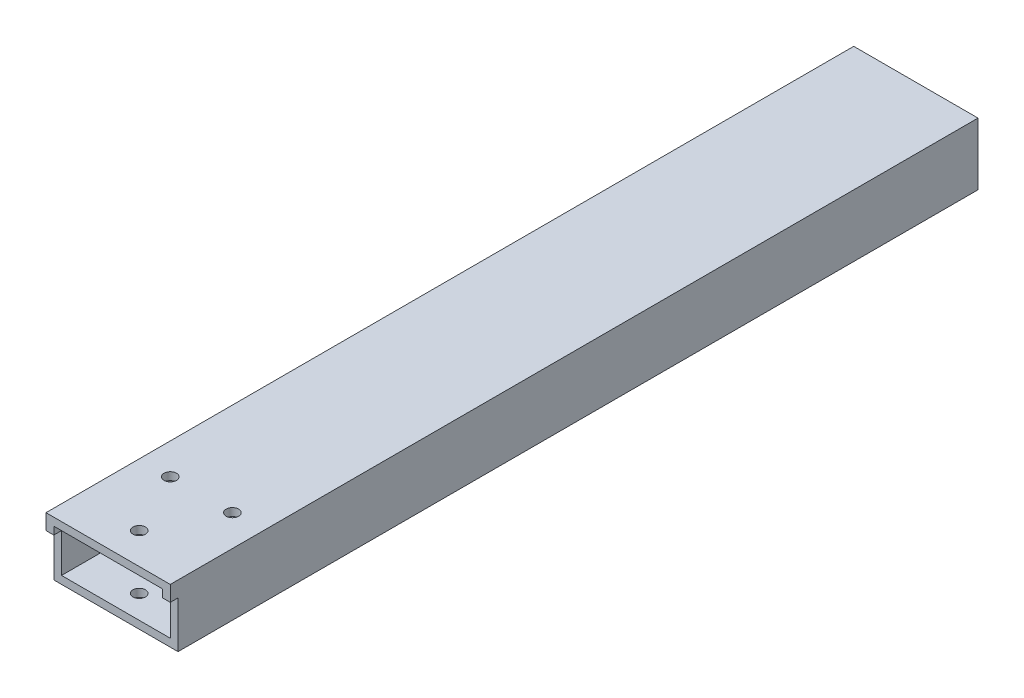
ISO-10303-21;
HEADER;
FILE_DESCRIPTION(('STEP AP214'),'2;1');
FILE_NAME('part.step','',(''),(''),'','','');
FILE_SCHEMA(('AUTOMOTIVE_DESIGN { 1 0 10303 214 1 1 1 1 }'));
ENDSEC;
DATA;
#1=APPLICATION_CONTEXT('core data for automotive mechanical design processes');
#2=APPLICATION_PROTOCOL_DEFINITION('international standard','automotive_design',2000,#1);
#3=PRODUCT_CONTEXT('',#1,'mechanical');
#4=PRODUCT('Part','Part','',(#3));
#5=PRODUCT_RELATED_PRODUCT_CATEGORY('part','',(#4));
#6=PRODUCT_DEFINITION_FORMATION('','',#4);
#7=PRODUCT_DEFINITION_CONTEXT('part definition',#1,'design');
#8=PRODUCT_DEFINITION('design','',#6,#7);
#9=PRODUCT_DEFINITION_SHAPE('','',#8);
#10=(LENGTH_UNIT() NAMED_UNIT(*) SI_UNIT(.MILLI.,.METRE.));
#11=(NAMED_UNIT(*) PLANE_ANGLE_UNIT() SI_UNIT($,.RADIAN.));
#12=(NAMED_UNIT(*) SI_UNIT($,.STERADIAN.) SOLID_ANGLE_UNIT());
#13=UNCERTAINTY_MEASURE_WITH_UNIT(LENGTH_MEASURE(1.E-05),#10,'distance_accuracy_value','');
#14=(GEOMETRIC_REPRESENTATION_CONTEXT(3) GLOBAL_UNCERTAINTY_ASSIGNED_CONTEXT((#13)) GLOBAL_UNIT_ASSIGNED_CONTEXT((#10,
#11,#12)) REPRESENTATION_CONTEXT('',''));
#15=CARTESIAN_POINT('',(0.,0.,0.));
#16=DIRECTION('',(0.,0.,1.));
#17=DIRECTION('',(1.,0.,0.));
#18=AXIS2_PLACEMENT_3D('',#15,#16,#17);
#19=CARTESIAN_POINT('',(0.,0.,330.2));
#20=DIRECTION('',(0.,0.,-1.));
#21=DIRECTION('',(-1.,0.,0.));
#22=AXIS2_PLACEMENT_3D('',#19,#20,#21);
#23=PLANE('',#22);
#24=DIRECTION('',(0.,-1.,0.));
#25=VECTOR('',#24,1.);
#26=CARTESIAN_POINT('',(0.,0.,330.2));
#27=LINE('',#26,#25);
#28=CARTESIAN_POINT('',(0.,25.4,330.2));
#29=VERTEX_POINT('',#28);
#30=CARTESIAN_POINT('',(0.,19.05,330.2));
#31=VERTEX_POINT('',#30);
#32=EDGE_CURVE('E227',#29,#31,#27,.T.);
#33=ORIENTED_EDGE('',*,*,#32,.T.);
#34=DIRECTION('',(-1.,0.,0.));
#35=VECTOR('',#34,1.);
#36=CARTESIAN_POINT('',(0.,19.05,330.2));
#37=LINE('',#36,#35);
#38=CARTESIAN_POINT('',(3.175,19.05,330.2));
#39=VERTEX_POINT('',#38);
#40=EDGE_CURVE('E185',#39,#31,#37,.T.);
#41=ORIENTED_EDGE('',*,*,#40,.F.);
#42=DIRECTION('',(0.,-1.,0.));
#43=VECTOR('',#42,1.);
#44=CARTESIAN_POINT('',(3.175,3.175,330.2));
#45=LINE('',#44,#43);
#46=CARTESIAN_POINT('',(3.175,22.225,330.2));
#47=VERTEX_POINT('',#46);
#48=EDGE_CURVE('E201',#47,#39,#45,.T.);
#49=ORIENTED_EDGE('',*,*,#48,.F.);
#50=DIRECTION('',(-1.,0.,0.));
#51=VECTOR('',#50,1.);
#52=CARTESIAN_POINT('',(3.175,22.225,330.2));
#53=LINE('',#52,#51);
#54=CARTESIAN_POINT('',(47.625,22.225,330.2));
#55=VERTEX_POINT('',#54);
#56=EDGE_CURVE('E206',#55,#47,#53,.T.);
#57=ORIENTED_EDGE('',*,*,#56,.F.);
#58=DIRECTION('',(0.,1.,0.));
#59=VECTOR('',#58,1.);
#60=CARTESIAN_POINT('',(47.625,3.175,330.2));
#61=LINE('',#60,#59);
#62=CARTESIAN_POINT('',(47.625,19.05,330.2));
#63=VERTEX_POINT('',#62);
#64=EDGE_CURVE('E57',#63,#55,#61,.T.);
#65=ORIENTED_EDGE('',*,*,#64,.F.);
#66=CARTESIAN_POINT('',(50.8,19.05,330.2));
#67=VERTEX_POINT('',#66);
#68=EDGE_CURVE('E133',#67,#63,#37,.T.);
#69=ORIENTED_EDGE('',*,*,#68,.F.);
#70=DIRECTION('',(0.,1.,0.));
#71=VECTOR('',#70,1.);
#72=CARTESIAN_POINT('',(50.8,0.,330.2));
#73=LINE('',#72,#71);
#74=CARTESIAN_POINT('',(50.8,25.4,330.2));
#75=VERTEX_POINT('',#74);
#76=EDGE_CURVE('E230',#67,#75,#73,.T.);
#77=ORIENTED_EDGE('',*,*,#76,.T.);
#78=DIRECTION('',(-1.,0.,0.));
#79=VECTOR('',#78,1.);
#80=CARTESIAN_POINT('',(0.,25.4,330.2));
#81=LINE('',#80,#79);
#82=EDGE_CURVE('E233',#75,#29,#81,.T.);
#83=ORIENTED_EDGE('',*,*,#82,.T.);
#84=EDGE_LOOP('',(#33,#41,#49,#57,#65,#69,#77,#83));
#85=FACE_BOUND('',#84,.T.);
#86=ADVANCED_FACE('F33',(#85),#23,.F.);
#87=CARTESIAN_POINT('',(0.,0.,0.));
#88=DIRECTION('',(0.,0.,-1.));
#89=DIRECTION('',(-1.,0.,0.));
#90=AXIS2_PLACEMENT_3D('',#87,#88,#89);
#91=PLANE('',#90);
#92=DIRECTION('',(0.,-1.,0.));
#93=VECTOR('',#92,1.);
#94=CARTESIAN_POINT('',(0.,0.,0.));
#95=LINE('',#94,#93);
#96=CARTESIAN_POINT('',(0.,25.4,0.));
#97=VERTEX_POINT('',#96);
#98=CARTESIAN_POINT('',(0.,0.,0.));
#99=VERTEX_POINT('',#98);
#100=EDGE_CURVE('E147',#97,#99,#95,.T.);
#101=ORIENTED_EDGE('',*,*,#100,.F.);
#102=DIRECTION('',(-1.,0.,0.));
#103=VECTOR('',#102,1.);
#104=CARTESIAN_POINT('',(0.,25.4,0.));
#105=LINE('',#104,#103);
#106=CARTESIAN_POINT('',(50.8,25.4,0.));
#107=VERTEX_POINT('',#106);
#108=EDGE_CURVE('E231',#107,#97,#105,.T.);
#109=ORIENTED_EDGE('',*,*,#108,.F.);
#110=DIRECTION('',(0.,1.,0.));
#111=VECTOR('',#110,1.);
#112=CARTESIAN_POINT('',(50.8,0.,0.));
#113=LINE('',#112,#111);
#114=CARTESIAN_POINT('',(50.8,0.,0.));
#115=VERTEX_POINT('',#114);
#116=EDGE_CURVE('E239',#115,#107,#113,.T.);
#117=ORIENTED_EDGE('',*,*,#116,.F.);
#118=DIRECTION('',(1.,0.,0.));
#119=VECTOR('',#118,1.);
#120=CARTESIAN_POINT('',(0.,0.,0.));
#121=LINE('',#120,#119);
#122=EDGE_CURVE('E237',#99,#115,#121,.T.);
#123=ORIENTED_EDGE('',*,*,#122,.F.);
#124=EDGE_LOOP('',(#101,#109,#117,#123));
#125=FACE_BOUND('',#124,.T.);
#126=DIRECTION('',(-1.,0.,0.));
#127=VECTOR('',#126,1.);
#128=CARTESIAN_POINT('',(3.175,22.225,0.));
#129=LINE('',#128,#127);
#130=CARTESIAN_POINT('',(47.625,22.225,0.));
#131=VERTEX_POINT('',#130);
#132=CARTESIAN_POINT('',(3.175,22.225,0.));
#133=VERTEX_POINT('',#132);
#134=EDGE_CURVE('E204',#131,#133,#129,.T.);
#135=ORIENTED_EDGE('',*,*,#134,.T.);
#136=DIRECTION('',(0.,-1.,0.));
#137=VECTOR('',#136,1.);
#138=CARTESIAN_POINT('',(3.175,3.175,0.));
#139=LINE('',#138,#137);
#140=CARTESIAN_POINT('',(3.175,3.175,0.));
#141=VERTEX_POINT('',#140);
#142=EDGE_CURVE('E200',#133,#141,#139,.T.);
#143=ORIENTED_EDGE('',*,*,#142,.T.);
#144=DIRECTION('',(1.,0.,0.));
#145=VECTOR('',#144,1.);
#146=CARTESIAN_POINT('',(3.175,3.175,0.));
#147=LINE('',#146,#145);
#148=CARTESIAN_POINT('',(47.625,3.175,0.));
#149=VERTEX_POINT('',#148);
#150=EDGE_CURVE('E211',#141,#149,#147,.T.);
#151=ORIENTED_EDGE('',*,*,#150,.T.);
#152=DIRECTION('',(0.,1.,0.));
#153=VECTOR('',#152,1.);
#154=CARTESIAN_POINT('',(47.625,3.175,0.));
#155=LINE('',#154,#153);
#156=EDGE_CURVE('E214',#149,#131,#155,.T.);
#157=ORIENTED_EDGE('',*,*,#156,.T.);
#158=EDGE_LOOP('',(#135,#143,#151,#157));
#159=FACE_BOUND('',#158,.T.);
#160=ADVANCED_FACE('F253',(#125,#159),#91,.T.);
#161=CARTESIAN_POINT('',(0.,0.,330.2));
#162=DIRECTION('',(1.,0.,0.));
#163=DIRECTION('',(0.,0.,-1.));
#164=AXIS2_PLACEMENT_3D('',#161,#162,#163);
#165=PLANE('',#164);
#166=DIRECTION('',(0.,-1.,0.));
#167=VECTOR('',#166,1.);
#168=CARTESIAN_POINT('',(0.,0.,327.025));
#169=LINE('',#168,#167);
#170=CARTESIAN_POINT('',(0.,19.05,327.025));
#171=VERTEX_POINT('',#170);
#172=CARTESIAN_POINT('',(0.,0.,327.025));
#173=VERTEX_POINT('',#172);
#174=EDGE_CURVE('E122',#171,#173,#169,.T.);
#175=ORIENTED_EDGE('',*,*,#174,.F.);
#176=DIRECTION('',(0.,0.,1.));
#177=VECTOR('',#176,1.);
#178=CARTESIAN_POINT('',(0.,19.05,327.025));
#179=LINE('',#178,#177);
#180=EDGE_CURVE('E191',#171,#31,#179,.T.);
#181=ORIENTED_EDGE('',*,*,#180,.T.);
#182=ORIENTED_EDGE('',*,*,#32,.F.);
#183=DIRECTION('',(0.,0.,-1.));
#184=VECTOR('',#183,1.);
#185=CARTESIAN_POINT('',(0.,25.4,330.2));
#186=LINE('',#185,#184);
#187=EDGE_CURVE('E235',#29,#97,#186,.T.);
#188=ORIENTED_EDGE('',*,*,#187,.T.);
#189=ORIENTED_EDGE('',*,*,#100,.T.);
#190=DIRECTION('',(0.,0.,-1.));
#191=VECTOR('',#190,1.);
#192=CARTESIAN_POINT('',(0.,0.,330.2));
#193=LINE('',#192,#191);
#194=EDGE_CURVE('E139',#173,#99,#193,.T.);
#195=ORIENTED_EDGE('',*,*,#194,.F.);
#196=EDGE_LOOP('',(#175,#181,#182,#188,#189,#195));
#197=FACE_BOUND('',#196,.T.);
#198=ADVANCED_FACE('F35',(#197),#165,.F.);
#199=CARTESIAN_POINT('',(0.,0.,330.2));
#200=DIRECTION('',(0.,1.,0.));
#201=DIRECTION('',(0.,0.,1.));
#202=AXIS2_PLACEMENT_3D('',#199,#200,#201);
#203=PLANE('',#202);
#204=CARTESIAN_POINT('',(25.4,0.,317.5));
#205=DIRECTION('',(0.,1.,0.));
#206=DIRECTION('',(0.,0.,1.));
#207=AXIS2_PLACEMENT_3D('',#204,#205,#206);
#208=CIRCLE('',#207,2.55269999999998);
#209=CARTESIAN_POINT('',(25.4,0.,320.0527));
#210=VERTEX_POINT('',#209);
#211=EDGE_CURVE('E168',#210,#210,#208,.T.);
#212=ORIENTED_EDGE('',*,*,#211,.T.);
#213=EDGE_LOOP('',(#212));
#214=FACE_BOUND('',#213,.T.);
#215=CARTESIAN_POINT('',(38.1,0.,292.1));
#216=DIRECTION('',(0.,1.,0.));
#217=DIRECTION('',(0.,0.,1.));
#218=AXIS2_PLACEMENT_3D('',#215,#216,#217);
#219=CIRCLE('',#218,2.55269999999997);
#220=CARTESIAN_POINT('',(38.1,0.,294.6527));
#221=VERTEX_POINT('',#220);
#222=EDGE_CURVE('E165',#221,#221,#219,.T.);
#223=ORIENTED_EDGE('',*,*,#222,.T.);
#224=EDGE_LOOP('',(#223));
#225=FACE_BOUND('',#224,.T.);
#226=CARTESIAN_POINT('',(12.7,0.,292.1));
#227=DIRECTION('',(0.,1.,0.));
#228=DIRECTION('',(0.,0.,1.));
#229=AXIS2_PLACEMENT_3D('',#226,#227,#228);
#230=CIRCLE('',#229,2.55269999999998);
#231=CARTESIAN_POINT('',(12.7,0.,294.6527));
#232=VERTEX_POINT('',#231);
#233=EDGE_CURVE('E183',#232,#232,#230,.T.);
#234=ORIENTED_EDGE('',*,*,#233,.T.);
#235=EDGE_LOOP('',(#234));
#236=FACE_BOUND('',#235,.T.);
#237=DIRECTION('',(0.,0.,-1.));
#238=VECTOR('',#237,1.);
#239=CARTESIAN_POINT('',(50.8,0.,330.2));
#240=LINE('',#239,#238);
#241=CARTESIAN_POINT('',(50.8,0.,327.025));
#242=VERTEX_POINT('',#241);
#243=EDGE_CURVE('E141',#242,#115,#240,.T.);
#244=ORIENTED_EDGE('',*,*,#243,.F.);
#245=DIRECTION('',(1.,0.,0.));
#246=VECTOR('',#245,1.);
#247=CARTESIAN_POINT('',(0.,0.,327.025));
#248=LINE('',#247,#246);
#249=EDGE_CURVE('E125',#173,#242,#248,.T.);
#250=ORIENTED_EDGE('',*,*,#249,.F.);
#251=ORIENTED_EDGE('',*,*,#194,.T.);
#252=ORIENTED_EDGE('',*,*,#122,.T.);
#253=EDGE_LOOP('',(#244,#250,#251,#252));
#254=FACE_BOUND('',#253,.T.);
#255=ADVANCED_FACE('F137',(#214,#225,#236,#254),#203,.F.);
#256=CARTESIAN_POINT('',(50.8,0.,330.2));
#257=DIRECTION('',(-1.,0.,0.));
#258=DIRECTION('',(0.,0.,1.));
#259=AXIS2_PLACEMENT_3D('',#256,#257,#258);
#260=PLANE('',#259);
#261=ORIENTED_EDGE('',*,*,#76,.F.);
#262=DIRECTION('',(0.,0.,1.));
#263=VECTOR('',#262,1.);
#264=CARTESIAN_POINT('',(50.8,19.05,327.025));
#265=LINE('',#264,#263);
#266=CARTESIAN_POINT('',(50.8,19.05,327.025));
#267=VERTEX_POINT('',#266);
#268=EDGE_CURVE('E189',#267,#67,#265,.T.);
#269=ORIENTED_EDGE('',*,*,#268,.F.);
#270=DIRECTION('',(0.,1.,0.));
#271=VECTOR('',#270,1.);
#272=CARTESIAN_POINT('',(50.8,0.,327.025));
#273=LINE('',#272,#271);
#274=EDGE_CURVE('E142',#242,#267,#273,.T.);
#275=ORIENTED_EDGE('',*,*,#274,.F.);
#276=ORIENTED_EDGE('',*,*,#243,.T.);
#277=ORIENTED_EDGE('',*,*,#116,.T.);
#278=DIRECTION('',(0.,0.,-1.));
#279=VECTOR('',#278,1.);
#280=CARTESIAN_POINT('',(50.8,25.4,330.2));
#281=LINE('',#280,#279);
#282=EDGE_CURVE('E150',#75,#107,#281,.T.);
#283=ORIENTED_EDGE('',*,*,#282,.F.);
#284=EDGE_LOOP('',(#261,#269,#275,#276,#277,#283));
#285=FACE_BOUND('',#284,.T.);
#286=ADVANCED_FACE('F255',(#285),#260,.F.);
#287=CARTESIAN_POINT('',(0.,25.4,330.2));
#288=DIRECTION('',(0.,-1.,0.));
#289=DIRECTION('',(0.,0.,-1.));
#290=AXIS2_PLACEMENT_3D('',#287,#288,#289);
#291=PLANE('',#290);
#292=CARTESIAN_POINT('',(25.4,25.4,317.5));
#293=DIRECTION('',(0.,1.,0.));
#294=DIRECTION('',(0.,0.,1.));
#295=AXIS2_PLACEMENT_3D('',#292,#293,#294);
#296=CIRCLE('',#295,2.55269999999998);
#297=CARTESIAN_POINT('',(25.4,25.4,320.0527));
#298=VERTEX_POINT('',#297);
#299=EDGE_CURVE('E412',#298,#298,#296,.T.);
#300=ORIENTED_EDGE('',*,*,#299,.F.);
#301=EDGE_LOOP('',(#300));
#302=FACE_BOUND('',#301,.T.);
#303=CARTESIAN_POINT('',(38.1,25.4,292.1));
#304=DIRECTION('',(0.,1.,0.));
#305=DIRECTION('',(0.,0.,1.));
#306=AXIS2_PLACEMENT_3D('',#303,#304,#305);
#307=CIRCLE('',#306,2.55269999999997);
#308=CARTESIAN_POINT('',(38.1,25.4,294.6527));
#309=VERTEX_POINT('',#308);
#310=EDGE_CURVE('E161',#309,#309,#307,.T.);
#311=ORIENTED_EDGE('',*,*,#310,.F.);
#312=EDGE_LOOP('',(#311));
#313=FACE_BOUND('',#312,.T.);
#314=CARTESIAN_POINT('',(12.7,25.4,292.1));
#315=DIRECTION('',(0.,1.,0.));
#316=DIRECTION('',(0.,0.,1.));
#317=AXIS2_PLACEMENT_3D('',#314,#315,#316);
#318=CIRCLE('',#317,2.55269999999998);
#319=CARTESIAN_POINT('',(12.7,25.4,294.6527));
#320=VERTEX_POINT('',#319);
#321=EDGE_CURVE('E157',#320,#320,#318,.T.);
#322=ORIENTED_EDGE('',*,*,#321,.F.);
#323=EDGE_LOOP('',(#322));
#324=FACE_BOUND('',#323,.T.);
#325=ORIENTED_EDGE('',*,*,#108,.T.);
#326=ORIENTED_EDGE('',*,*,#187,.F.);
#327=ORIENTED_EDGE('',*,*,#82,.F.);
#328=ORIENTED_EDGE('',*,*,#282,.T.);
#329=EDGE_LOOP('',(#325,#326,#327,#328));
#330=FACE_BOUND('',#329,.T.);
#331=ADVANCED_FACE('F247',(#302,#313,#324,#330),#291,.F.);
#332=CARTESIAN_POINT('',(3.175,3.175,330.2));
#333=DIRECTION('',(1.,0.,0.));
#334=DIRECTION('',(0.,0.,-1.));
#335=AXIS2_PLACEMENT_3D('',#332,#333,#334);
#336=PLANE('',#335);
#337=DIRECTION('',(0.,0.,1.));
#338=VECTOR('',#337,1.);
#339=CARTESIAN_POINT('',(3.175,19.05,330.2));
#340=LINE('',#339,#338);
#341=CARTESIAN_POINT('',(3.175,19.05,327.025));
#342=VERTEX_POINT('',#341);
#343=EDGE_CURVE('E198',#342,#39,#340,.T.);
#344=ORIENTED_EDGE('',*,*,#343,.F.);
#345=DIRECTION('',(0.,1.,0.));
#346=VECTOR('',#345,1.);
#347=CARTESIAN_POINT('',(3.175,3.175,327.025));
#348=LINE('',#347,#346);
#349=CARTESIAN_POINT('',(3.175,3.175,327.025));
#350=VERTEX_POINT('',#349);
#351=EDGE_CURVE('E196',#350,#342,#348,.T.);
#352=ORIENTED_EDGE('',*,*,#351,.F.);
#353=DIRECTION('',(0.,0.,-1.));
#354=VECTOR('',#353,1.);
#355=CARTESIAN_POINT('',(3.175,3.175,330.2));
#356=LINE('',#355,#354);
#357=EDGE_CURVE('E225',#350,#141,#356,.T.);
#358=ORIENTED_EDGE('',*,*,#357,.T.);
#359=ORIENTED_EDGE('',*,*,#142,.F.);
#360=DIRECTION('',(0.,0.,-1.));
#361=VECTOR('',#360,1.);
#362=CARTESIAN_POINT('',(3.175,22.225,330.2));
#363=LINE('',#362,#361);
#364=EDGE_CURVE('E208',#47,#133,#363,.T.);
#365=ORIENTED_EDGE('',*,*,#364,.F.);
#366=ORIENTED_EDGE('',*,*,#48,.T.);
#367=EDGE_LOOP('',(#344,#352,#358,#359,#365,#366));
#368=FACE_BOUND('',#367,.T.);
#369=ADVANCED_FACE('F272',(#368),#336,.T.);
#370=CARTESIAN_POINT('',(3.175,3.175,330.2));
#371=DIRECTION('',(0.,1.,0.));
#372=DIRECTION('',(0.,0.,1.));
#373=AXIS2_PLACEMENT_3D('',#370,#371,#372);
#374=PLANE('',#373);
#375=CARTESIAN_POINT('',(25.4,3.175,317.5));
#376=DIRECTION('',(0.,1.,0.));
#377=DIRECTION('',(0.,0.,1.));
#378=AXIS2_PLACEMENT_3D('',#375,#376,#377);
#379=CIRCLE('',#378,2.55269999999998);
#380=CARTESIAN_POINT('',(25.4,3.175,320.0527));
#381=VERTEX_POINT('',#380);
#382=EDGE_CURVE('E173',#381,#381,#379,.T.);
#383=ORIENTED_EDGE('',*,*,#382,.F.);
#384=EDGE_LOOP('',(#383));
#385=FACE_BOUND('',#384,.T.);
#386=CARTESIAN_POINT('',(38.1,3.175,292.1));
#387=DIRECTION('',(0.,1.,0.));
#388=DIRECTION('',(0.,0.,1.));
#389=AXIS2_PLACEMENT_3D('',#386,#387,#388);
#390=CIRCLE('',#389,2.55269999999997);
#391=CARTESIAN_POINT('',(38.1,3.175,294.6527));
#392=VERTEX_POINT('',#391);
#393=EDGE_CURVE('E160',#392,#392,#390,.T.);
#394=ORIENTED_EDGE('',*,*,#393,.F.);
#395=EDGE_LOOP('',(#394));
#396=FACE_BOUND('',#395,.T.);
#397=CARTESIAN_POINT('',(12.7,3.175,292.1));
#398=DIRECTION('',(0.,1.,0.));
#399=DIRECTION('',(0.,0.,1.));
#400=AXIS2_PLACEMENT_3D('',#397,#398,#399);
#401=CIRCLE('',#400,2.55269999999998);
#402=CARTESIAN_POINT('',(12.7,3.175,294.6527));
#403=VERTEX_POINT('',#402);
#404=EDGE_CURVE('E156',#403,#403,#401,.T.);
#405=ORIENTED_EDGE('',*,*,#404,.F.);
#406=EDGE_LOOP('',(#405));
#407=FACE_BOUND('',#406,.T.);
#408=DIRECTION('',(-1.,0.,0.));
#409=VECTOR('',#408,1.);
#410=CARTESIAN_POINT('',(3.175,3.175,327.025));
#411=LINE('',#410,#409);
#412=CARTESIAN_POINT('',(47.625,3.175,327.025));
#413=VERTEX_POINT('',#412);
#414=EDGE_CURVE('E193',#413,#350,#411,.T.);
#415=ORIENTED_EDGE('',*,*,#414,.F.);
#416=DIRECTION('',(0.,0.,-1.));
#417=VECTOR('',#416,1.);
#418=CARTESIAN_POINT('',(47.625,3.175,330.2));
#419=LINE('',#418,#417);
#420=EDGE_CURVE('E223',#413,#149,#419,.T.);
#421=ORIENTED_EDGE('',*,*,#420,.T.);
#422=ORIENTED_EDGE('',*,*,#150,.F.);
#423=ORIENTED_EDGE('',*,*,#357,.F.);
#424=EDGE_LOOP('',(#415,#421,#422,#423));
#425=FACE_BOUND('',#424,.T.);
#426=ADVANCED_FACE('F268',(#385,#396,#407,#425),#374,.T.);
#427=CARTESIAN_POINT('',(47.625,3.175,330.2));
#428=DIRECTION('',(-1.,0.,0.));
#429=DIRECTION('',(0.,0.,1.));
#430=AXIS2_PLACEMENT_3D('',#427,#428,#429);
#431=PLANE('',#430);
#432=DIRECTION('',(0.,0.,-1.));
#433=VECTOR('',#432,1.);
#434=CARTESIAN_POINT('',(47.625,19.05,330.2));
#435=LINE('',#434,#433);
#436=CARTESIAN_POINT('',(47.625,19.05,327.025));
#437=VERTEX_POINT('',#436);
#438=EDGE_CURVE('E11',#63,#437,#435,.T.);
#439=ORIENTED_EDGE('',*,*,#438,.F.);
#440=ORIENTED_EDGE('',*,*,#64,.T.);
#441=DIRECTION('',(0.,0.,-1.));
#442=VECTOR('',#441,1.);
#443=CARTESIAN_POINT('',(47.625,22.225,330.2));
#444=LINE('',#443,#442);
#445=EDGE_CURVE('E221',#55,#131,#444,.T.);
#446=ORIENTED_EDGE('',*,*,#445,.T.);
#447=ORIENTED_EDGE('',*,*,#156,.F.);
#448=ORIENTED_EDGE('',*,*,#420,.F.);
#449=DIRECTION('',(0.,-1.,0.));
#450=VECTOR('',#449,1.);
#451=CARTESIAN_POINT('',(47.625,3.175,327.025));
#452=LINE('',#451,#450);
#453=EDGE_CURVE('E42',#437,#413,#452,.T.);
#454=ORIENTED_EDGE('',*,*,#453,.F.);
#455=EDGE_LOOP('',(#439,#440,#446,#447,#448,#454));
#456=FACE_BOUND('',#455,.T.);
#457=ADVANCED_FACE('F262',(#456),#431,.T.);
#458=CARTESIAN_POINT('',(3.175,22.225,330.2));
#459=DIRECTION('',(0.,-1.,0.));
#460=DIRECTION('',(0.,0.,-1.));
#461=AXIS2_PLACEMENT_3D('',#458,#459,#460);
#462=PLANE('',#461);
#463=CARTESIAN_POINT('',(25.4,22.225,317.5));
#464=DIRECTION('',(0.,-1.,0.));
#465=DIRECTION('',(0.,0.,-1.));
#466=AXIS2_PLACEMENT_3D('',#463,#464,#465);
#467=CIRCLE('',#466,2.55269999999998);
#468=CARTESIAN_POINT('',(25.4,22.225,314.9473));
#469=VERTEX_POINT('',#468);
#470=EDGE_CURVE('E37',#469,#469,#467,.T.);
#471=ORIENTED_EDGE('',*,*,#470,.F.);
#472=EDGE_LOOP('',(#471));
#473=FACE_BOUND('',#472,.T.);
#474=CARTESIAN_POINT('',(38.1,22.225,292.1));
#475=DIRECTION('',(0.,-1.,0.));
#476=DIRECTION('',(0.,0.,-1.));
#477=AXIS2_PLACEMENT_3D('',#474,#475,#476);
#478=CIRCLE('',#477,2.55269999999997);
#479=CARTESIAN_POINT('',(38.1,22.225,289.5473));
#480=VERTEX_POINT('',#479);
#481=EDGE_CURVE('E158',#480,#480,#478,.T.);
#482=ORIENTED_EDGE('',*,*,#481,.F.);
#483=EDGE_LOOP('',(#482));
#484=FACE_BOUND('',#483,.T.);
#485=CARTESIAN_POINT('',(12.7,22.225,292.1));
#486=DIRECTION('',(0.,-1.,0.));
#487=DIRECTION('',(0.,0.,-1.));
#488=AXIS2_PLACEMENT_3D('',#485,#486,#487);
#489=CIRCLE('',#488,2.55269999999998);
#490=CARTESIAN_POINT('',(12.7,22.225,289.5473));
#491=VERTEX_POINT('',#490);
#492=EDGE_CURVE('E154',#491,#491,#489,.T.);
#493=ORIENTED_EDGE('',*,*,#492,.F.);
#494=EDGE_LOOP('',(#493));
#495=FACE_BOUND('',#494,.T.);
#496=ORIENTED_EDGE('',*,*,#134,.F.);
#497=ORIENTED_EDGE('',*,*,#445,.F.);
#498=ORIENTED_EDGE('',*,*,#56,.T.);
#499=ORIENTED_EDGE('',*,*,#364,.T.);
#500=EDGE_LOOP('',(#496,#497,#498,#499));
#501=FACE_BOUND('',#500,.T.);
#502=ADVANCED_FACE('F283',(#473,#484,#495,#501),#462,.T.);
#503=CARTESIAN_POINT('',(0.,19.05,327.025));
#504=DIRECTION('',(0.,1.,0.));
#505=DIRECTION('',(0.,0.,1.));
#506=AXIS2_PLACEMENT_3D('',#503,#504,#505);
#507=PLANE('',#506);
#508=ORIENTED_EDGE('',*,*,#343,.T.);
#509=ORIENTED_EDGE('',*,*,#40,.T.);
#510=ORIENTED_EDGE('',*,*,#180,.F.);
#511=DIRECTION('',(-1.,0.,0.));
#512=VECTOR('',#511,1.);
#513=CARTESIAN_POINT('',(0.,19.05,327.025));
#514=LINE('',#513,#512);
#515=EDGE_CURVE('E128',#342,#171,#514,.T.);
#516=ORIENTED_EDGE('',*,*,#515,.F.);
#517=EDGE_LOOP('',(#508,#509,#510,#516));
#518=FACE_BOUND('',#517,.T.);
#519=ADVANCED_FACE('F275',(#518),#507,.F.);
#520=ORIENTED_EDGE('',*,*,#438,.T.);
#521=EDGE_CURVE('E50',#267,#437,#514,.T.);
#522=ORIENTED_EDGE('',*,*,#521,.F.);
#523=ORIENTED_EDGE('',*,*,#268,.T.);
#524=ORIENTED_EDGE('',*,*,#68,.T.);
#525=EDGE_LOOP('',(#520,#522,#523,#524));
#526=FACE_BOUND('',#525,.T.);
#527=ADVANCED_FACE('F258',(#526),#507,.F.);
#528=CARTESIAN_POINT('',(0.,0.,327.025));
#529=DIRECTION('',(0.,0.,-1.));
#530=DIRECTION('',(-1.,0.,0.));
#531=AXIS2_PLACEMENT_3D('',#528,#529,#530);
#532=PLANE('',#531);
#533=ORIENTED_EDGE('',*,*,#351,.T.);
#534=ORIENTED_EDGE('',*,*,#515,.T.);
#535=ORIENTED_EDGE('',*,*,#174,.T.);
#536=ORIENTED_EDGE('',*,*,#249,.T.);
#537=ORIENTED_EDGE('',*,*,#274,.T.);
#538=ORIENTED_EDGE('',*,*,#521,.T.);
#539=ORIENTED_EDGE('',*,*,#453,.T.);
#540=ORIENTED_EDGE('',*,*,#414,.T.);
#541=EDGE_LOOP('',(#533,#534,#535,#536,#537,#538,#539,#540));
#542=FACE_BOUND('',#541,.T.);
#543=ADVANCED_FACE('F124',(#542),#532,.F.);
#544=CARTESIAN_POINT('',(12.7,-19.05,292.1));
#545=DIRECTION('',(0.,1.,0.));
#546=DIRECTION('',(0.,0.,1.));
#547=AXIS2_PLACEMENT_3D('',#544,#545,#546);
#548=CYLINDRICAL_SURFACE('',#547,2.55269999999998);
#549=ORIENTED_EDGE('',*,*,#492,.T.);
#550=EDGE_LOOP('',(#549));
#551=FACE_BOUND('',#550,.T.);
#552=ORIENTED_EDGE('',*,*,#321,.T.);
#553=EDGE_LOOP('',(#552));
#554=FACE_BOUND('',#553,.T.);
#555=ADVANCED_FACE('F310',(#551,#554),#548,.F.);
#556=ORIENTED_EDGE('',*,*,#404,.T.);
#557=EDGE_LOOP('',(#556));
#558=FACE_BOUND('',#557,.T.);
#559=ORIENTED_EDGE('',*,*,#233,.F.);
#560=EDGE_LOOP('',(#559));
#561=FACE_BOUND('',#560,.T.);
#562=ADVANCED_FACE('F307',(#558,#561),#548,.F.);
#563=CARTESIAN_POINT('',(38.1,-19.05,292.1));
#564=DIRECTION('',(0.,1.,0.));
#565=DIRECTION('',(0.,0.,1.));
#566=AXIS2_PLACEMENT_3D('',#563,#564,#565);
#567=CYLINDRICAL_SURFACE('',#566,2.55269999999997);
#568=ORIENTED_EDGE('',*,*,#481,.T.);
#569=EDGE_LOOP('',(#568));
#570=FACE_BOUND('',#569,.T.);
#571=ORIENTED_EDGE('',*,*,#310,.T.);
#572=EDGE_LOOP('',(#571));
#573=FACE_BOUND('',#572,.T.);
#574=ADVANCED_FACE('F309',(#570,#573),#567,.F.);
#575=ORIENTED_EDGE('',*,*,#393,.T.);
#576=EDGE_LOOP('',(#575));
#577=FACE_BOUND('',#576,.T.);
#578=ORIENTED_EDGE('',*,*,#222,.F.);
#579=EDGE_LOOP('',(#578));
#580=FACE_BOUND('',#579,.T.);
#581=ADVANCED_FACE('F317',(#577,#580),#567,.F.);
#582=CARTESIAN_POINT('',(25.4,-19.05,317.5));
#583=DIRECTION('',(0.,1.,0.));
#584=DIRECTION('',(0.,0.,1.));
#585=AXIS2_PLACEMENT_3D('',#582,#583,#584);
#586=CYLINDRICAL_SURFACE('',#585,2.55269999999998);
#587=ORIENTED_EDGE('',*,*,#470,.T.);
#588=EDGE_LOOP('',(#587));
#589=FACE_BOUND('',#588,.T.);
#590=ORIENTED_EDGE('',*,*,#299,.T.);
#591=EDGE_LOOP('',(#590));
#592=FACE_BOUND('',#591,.T.);
#593=ADVANCED_FACE('F387',(#589,#592),#586,.F.);
#594=ORIENTED_EDGE('',*,*,#382,.T.);
#595=EDGE_LOOP('',(#594));
#596=FACE_BOUND('',#595,.T.);
#597=ORIENTED_EDGE('',*,*,#211,.F.);
#598=EDGE_LOOP('',(#597));
#599=FACE_BOUND('',#598,.T.);
#600=ADVANCED_FACE('F396',(#596,#599),#586,.F.);
#601=CLOSED_SHELL('',(#86,#160,#198,#255,#286,#331,#369,#426,#457,#502,#519,#527,#543,#555,#562,
#574,#581,#593,#600));
#602=MANIFOLD_SOLID_BREP('B2',#601);
#603=ADVANCED_BREP_SHAPE_REPRESENTATION('',(#18,#602),#14);
#604=SHAPE_DEFINITION_REPRESENTATION(#9,#603);
ENDSEC;
END-ISO-10303-21;
